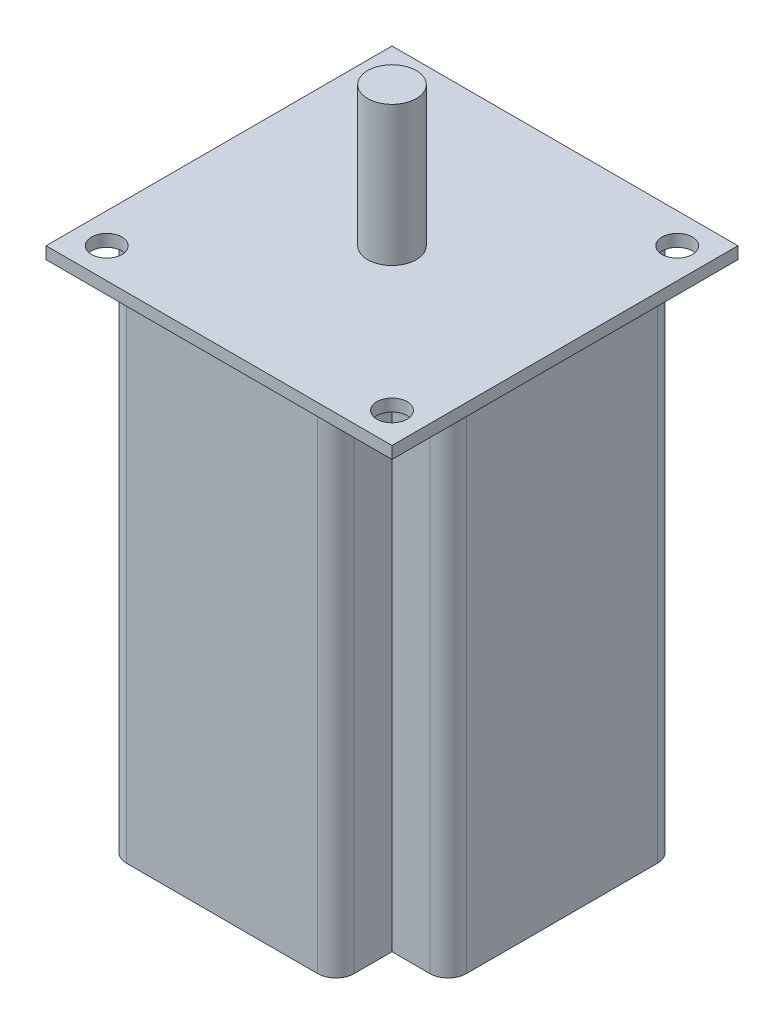
ISO-10303-21;
HEADER;
FILE_DESCRIPTION(('STEP AP214'),'2;1');
FILE_NAME('part.step','',(''),(''),'','','');
FILE_SCHEMA(('AUTOMOTIVE_DESIGN { 1 0 10303 214 1 1 1 1 }'));
ENDSEC;
DATA;
#1=APPLICATION_CONTEXT('core data for automotive mechanical design processes');
#2=APPLICATION_PROTOCOL_DEFINITION('international standard','automotive_design',2000,#1);
#3=PRODUCT_CONTEXT('',#1,'mechanical');
#4=PRODUCT('Part','Part','',(#3));
#5=PRODUCT_RELATED_PRODUCT_CATEGORY('part','',(#4));
#6=PRODUCT_DEFINITION_FORMATION('','',#4);
#7=PRODUCT_DEFINITION_CONTEXT('part definition',#1,'design');
#8=PRODUCT_DEFINITION('design','',#6,#7);
#9=PRODUCT_DEFINITION_SHAPE('','',#8);
#10=(LENGTH_UNIT() NAMED_UNIT(*) SI_UNIT(.MILLI.,.METRE.));
#11=(NAMED_UNIT(*) PLANE_ANGLE_UNIT() SI_UNIT($,.RADIAN.));
#12=(NAMED_UNIT(*) SI_UNIT($,.STERADIAN.) SOLID_ANGLE_UNIT());
#13=UNCERTAINTY_MEASURE_WITH_UNIT(LENGTH_MEASURE(1.E-05),#10,'distance_accuracy_value','');
#14=(GEOMETRIC_REPRESENTATION_CONTEXT(3) GLOBAL_UNCERTAINTY_ASSIGNED_CONTEXT((#13)) GLOBAL_UNIT_ASSIGNED_CONTEXT((#10,
#11,#12)) REPRESENTATION_CONTEXT('',''));
#15=CARTESIAN_POINT('',(0.,0.,0.));
#16=DIRECTION('',(0.,0.,1.));
#17=DIRECTION('',(1.,0.,0.));
#18=AXIS2_PLACEMENT_3D('',#15,#16,#17);
#19=CARTESIAN_POINT('',(-25.,82.,-15.75));
#20=DIRECTION('',(0.,-1.,0.));
#21=DIRECTION('',(0.,0.,-1.));
#22=AXIS2_PLACEMENT_3D('',#19,#20,#21);
#23=CYLINDRICAL_SURFACE('',#22,3.);
#24=DIRECTION('',(0.,-1.,0.));
#25=VECTOR('',#24,1.);
#26=CARTESIAN_POINT('',(-28.,82.,-15.75));
#27=LINE('',#26,#25);
#28=CARTESIAN_POINT('',(-28.,80.,-15.75));
#29=VERTEX_POINT('',#28);
#30=CARTESIAN_POINT('',(-28.,0.,-15.75));
#31=VERTEX_POINT('',#30);
#32=EDGE_CURVE('E49',#29,#31,#27,.T.);
#33=ORIENTED_EDGE('',*,*,#32,.F.);
#34=CARTESIAN_POINT('',(-25.,80.,-15.75));
#35=DIRECTION('',(0.,1.,0.));
#36=DIRECTION('',(0.,0.,1.));
#37=AXIS2_PLACEMENT_3D('',#34,#35,#36);
#38=CIRCLE('',#37,3.);
#39=CARTESIAN_POINT('',(-25.,80.,-18.75));
#40=VERTEX_POINT('',#39);
#41=EDGE_CURVE('E321',#29,#40,#38,.F.);
#42=ORIENTED_EDGE('',*,*,#41,.T.);
#43=DIRECTION('',(0.,-1.,0.));
#44=VECTOR('',#43,1.);
#45=CARTESIAN_POINT('',(-25.,82.,-18.75));
#46=LINE('',#45,#44);
#47=CARTESIAN_POINT('',(-25.,0.,-18.75));
#48=VERTEX_POINT('',#47);
#49=EDGE_CURVE('E63',#40,#48,#46,.T.);
#50=ORIENTED_EDGE('',*,*,#49,.T.);
#51=CARTESIAN_POINT('',(-25.,0.,-15.75));
#52=DIRECTION('',(0.,1.,0.));
#53=DIRECTION('',(0.,0.,1.));
#54=AXIS2_PLACEMENT_3D('',#51,#52,#53);
#55=CIRCLE('',#54,3.);
#56=EDGE_CURVE('E324',#31,#48,#55,.F.);
#57=ORIENTED_EDGE('',*,*,#56,.F.);
#58=EDGE_LOOP('',(#33,#42,#50,#57));
#59=FACE_BOUND('',#58,.T.);
#60=ADVANCED_FACE('F41',(#59),#23,.T.);
#61=CARTESIAN_POINT('',(-28.,82.,0.));
#62=DIRECTION('',(1.,0.,0.));
#63=DIRECTION('',(0.,0.,-1.));
#64=AXIS2_PLACEMENT_3D('',#61,#62,#63);
#65=PLANE('',#64);
#66=DIRECTION('',(0.,0.,1.));
#67=VECTOR('',#66,1.);
#68=CARTESIAN_POINT('',(-28.,80.,0.));
#69=LINE('',#68,#67);
#70=CARTESIAN_POINT('',(-28.,80.,15.75));
#71=VERTEX_POINT('',#70);
#72=EDGE_CURVE('E318',#29,#71,#69,.T.);
#73=ORIENTED_EDGE('',*,*,#72,.F.);
#74=ORIENTED_EDGE('',*,*,#32,.T.);
#75=DIRECTION('',(0.,0.,1.));
#76=VECTOR('',#75,1.);
#77=CARTESIAN_POINT('',(-28.,0.,0.));
#78=LINE('',#77,#76);
#79=CARTESIAN_POINT('',(-28.,0.,15.75));
#80=VERTEX_POINT('',#79);
#81=EDGE_CURVE('E327',#31,#80,#78,.T.);
#82=ORIENTED_EDGE('',*,*,#81,.T.);
#83=DIRECTION('',(0.,-1.,0.));
#84=VECTOR('',#83,1.);
#85=CARTESIAN_POINT('',(-28.,82.,15.75));
#86=LINE('',#85,#84);
#87=EDGE_CURVE('E456',#71,#80,#86,.T.);
#88=ORIENTED_EDGE('',*,*,#87,.F.);
#89=EDGE_LOOP('',(#73,#74,#82,#88));
#90=FACE_BOUND('',#89,.T.);
#91=ADVANCED_FACE('F463',(#90),#65,.F.);
#92=CARTESIAN_POINT('',(-25.,82.,15.75));
#93=DIRECTION('',(0.,-1.,0.));
#94=DIRECTION('',(0.,0.,-1.));
#95=AXIS2_PLACEMENT_3D('',#92,#93,#94);
#96=CYLINDRICAL_SURFACE('',#95,3.);
#97=CARTESIAN_POINT('',(-25.,80.,15.75));
#98=DIRECTION('',(0.,1.,0.));
#99=DIRECTION('',(0.,0.,1.));
#100=AXIS2_PLACEMENT_3D('',#97,#98,#99);
#101=CIRCLE('',#100,3.);
#102=CARTESIAN_POINT('',(-25.,80.,18.75));
#103=VERTEX_POINT('',#102);
#104=EDGE_CURVE('E315',#71,#103,#101,.T.);
#105=ORIENTED_EDGE('',*,*,#104,.F.);
#106=ORIENTED_EDGE('',*,*,#87,.T.);
#107=CARTESIAN_POINT('',(-25.,0.,15.75));
#108=DIRECTION('',(0.,1.,0.));
#109=DIRECTION('',(0.,0.,1.));
#110=AXIS2_PLACEMENT_3D('',#107,#108,#109);
#111=CIRCLE('',#110,3.);
#112=CARTESIAN_POINT('',(-25.,0.,18.75));
#113=VERTEX_POINT('',#112);
#114=EDGE_CURVE('E331',#80,#113,#111,.T.);
#115=ORIENTED_EDGE('',*,*,#114,.T.);
#116=DIRECTION('',(0.,-1.,0.));
#117=VECTOR('',#116,1.);
#118=CARTESIAN_POINT('',(-25.,82.,18.75));
#119=LINE('',#118,#117);
#120=EDGE_CURVE('E453',#103,#113,#119,.T.);
#121=ORIENTED_EDGE('',*,*,#120,.F.);
#122=EDGE_LOOP('',(#105,#106,#115,#121));
#123=FACE_BOUND('',#122,.T.);
#124=ADVANCED_FACE('F474',(#123),#96,.T.);
#125=CARTESIAN_POINT('',(0.,82.,18.75));
#126=DIRECTION('',(0.,0.,-1.));
#127=DIRECTION('',(-1.,0.,0.));
#128=AXIS2_PLACEMENT_3D('',#125,#126,#127);
#129=PLANE('',#128);
#130=DIRECTION('',(1.,0.,0.));
#131=VECTOR('',#130,1.);
#132=CARTESIAN_POINT('',(0.,80.,18.75));
#133=LINE('',#132,#131);
#134=CARTESIAN_POINT('',(-18.75,80.,18.75));
#135=VERTEX_POINT('',#134);
#136=EDGE_CURVE('E312',#103,#135,#133,.T.);
#137=ORIENTED_EDGE('',*,*,#136,.F.);
#138=ORIENTED_EDGE('',*,*,#120,.T.);
#139=DIRECTION('',(1.,0.,0.));
#140=VECTOR('',#139,1.);
#141=CARTESIAN_POINT('',(0.,0.,18.75));
#142=LINE('',#141,#140);
#143=CARTESIAN_POINT('',(-18.75,0.,18.75));
#144=VERTEX_POINT('',#143);
#145=EDGE_CURVE('E335',#113,#144,#142,.T.);
#146=ORIENTED_EDGE('',*,*,#145,.T.);
#147=DIRECTION('',(0.,-1.,0.));
#148=VECTOR('',#147,1.);
#149=CARTESIAN_POINT('',(-18.75,82.,18.75));
#150=LINE('',#149,#148);
#151=EDGE_CURVE('E450',#135,#144,#150,.T.);
#152=ORIENTED_EDGE('',*,*,#151,.F.);
#153=EDGE_LOOP('',(#137,#138,#146,#152));
#154=FACE_BOUND('',#153,.T.);
#155=ADVANCED_FACE('F478',(#154),#129,.F.);
#156=CARTESIAN_POINT('',(-18.75,82.,0.));
#157=DIRECTION('',(1.,0.,0.));
#158=DIRECTION('',(0.,0.,-1.));
#159=AXIS2_PLACEMENT_3D('',#156,#157,#158);
#160=PLANE('',#159);
#161=DIRECTION('',(0.,0.,1.));
#162=VECTOR('',#161,1.);
#163=CARTESIAN_POINT('',(-18.75,80.,0.));
#164=LINE('',#163,#162);
#165=CARTESIAN_POINT('',(-18.75,80.,25.));
#166=VERTEX_POINT('',#165);
#167=EDGE_CURVE('E309',#135,#166,#164,.T.);
#168=ORIENTED_EDGE('',*,*,#167,.F.);
#169=ORIENTED_EDGE('',*,*,#151,.T.);
#170=DIRECTION('',(0.,0.,1.));
#171=VECTOR('',#170,1.);
#172=CARTESIAN_POINT('',(-18.75,0.,0.));
#173=LINE('',#172,#171);
#174=CARTESIAN_POINT('',(-18.75,0.,25.));
#175=VERTEX_POINT('',#174);
#176=EDGE_CURVE('E339',#144,#175,#173,.T.);
#177=ORIENTED_EDGE('',*,*,#176,.T.);
#178=DIRECTION('',(0.,-1.,0.));
#179=VECTOR('',#178,1.);
#180=CARTESIAN_POINT('',(-18.75,82.,25.));
#181=LINE('',#180,#179);
#182=EDGE_CURVE('E447',#166,#175,#181,.T.);
#183=ORIENTED_EDGE('',*,*,#182,.F.);
#184=EDGE_LOOP('',(#168,#169,#177,#183));
#185=FACE_BOUND('',#184,.T.);
#186=ADVANCED_FACE('F484',(#185),#160,.F.);
#187=CARTESIAN_POINT('',(-15.75,82.,25.));
#188=DIRECTION('',(0.,-1.,0.));
#189=DIRECTION('',(0.,0.,-1.));
#190=AXIS2_PLACEMENT_3D('',#187,#188,#189);
#191=CYLINDRICAL_SURFACE('',#190,3.);
#192=DIRECTION('',(0.,-1.,0.));
#193=VECTOR('',#192,1.);
#194=CARTESIAN_POINT('',(-15.75,82.,28.));
#195=LINE('',#194,#193);
#196=CARTESIAN_POINT('',(-15.75,80.,28.));
#197=VERTEX_POINT('',#196);
#198=CARTESIAN_POINT('',(-15.75,0.,28.));
#199=VERTEX_POINT('',#198);
#200=EDGE_CURVE('E444',#197,#199,#195,.T.);
#201=ORIENTED_EDGE('',*,*,#200,.F.);
#202=CARTESIAN_POINT('',(-15.75,80.,25.));
#203=DIRECTION('',(0.,1.,0.));
#204=DIRECTION('',(0.,0.,1.));
#205=AXIS2_PLACEMENT_3D('',#202,#203,#204);
#206=CIRCLE('',#205,3.);
#207=EDGE_CURVE('E305',#197,#166,#206,.F.);
#208=ORIENTED_EDGE('',*,*,#207,.T.);
#209=ORIENTED_EDGE('',*,*,#182,.T.);
#210=CARTESIAN_POINT('',(-15.75,0.,25.));
#211=DIRECTION('',(0.,1.,0.));
#212=DIRECTION('',(0.,0.,1.));
#213=AXIS2_PLACEMENT_3D('',#210,#211,#212);
#214=CIRCLE('',#213,3.);
#215=EDGE_CURVE('E343',#199,#175,#214,.F.);
#216=ORIENTED_EDGE('',*,*,#215,.F.);
#217=EDGE_LOOP('',(#201,#208,#209,#216));
#218=FACE_BOUND('',#217,.T.);
#219=ADVANCED_FACE('F488',(#218),#191,.T.);
#220=CARTESIAN_POINT('',(0.,82.,28.));
#221=DIRECTION('',(0.,0.,-1.));
#222=DIRECTION('',(-1.,0.,0.));
#223=AXIS2_PLACEMENT_3D('',#220,#221,#222);
#224=PLANE('',#223);
#225=DIRECTION('',(1.,0.,0.));
#226=VECTOR('',#225,1.);
#227=CARTESIAN_POINT('',(0.,80.,28.));
#228=LINE('',#227,#226);
#229=CARTESIAN_POINT('',(15.75,80.,28.));
#230=VERTEX_POINT('',#229);
#231=EDGE_CURVE('E302',#197,#230,#228,.T.);
#232=ORIENTED_EDGE('',*,*,#231,.F.);
#233=ORIENTED_EDGE('',*,*,#200,.T.);
#234=DIRECTION('',(1.,0.,0.));
#235=VECTOR('',#234,1.);
#236=CARTESIAN_POINT('',(0.,0.,28.));
#237=LINE('',#236,#235);
#238=CARTESIAN_POINT('',(15.75,0.,28.));
#239=VERTEX_POINT('',#238);
#240=EDGE_CURVE('E347',#199,#239,#237,.T.);
#241=ORIENTED_EDGE('',*,*,#240,.T.);
#242=DIRECTION('',(0.,-1.,0.));
#243=VECTOR('',#242,1.);
#244=CARTESIAN_POINT('',(15.75,82.,28.));
#245=LINE('',#244,#243);
#246=EDGE_CURVE('E441',#230,#239,#245,.T.);
#247=ORIENTED_EDGE('',*,*,#246,.F.);
#248=EDGE_LOOP('',(#232,#233,#241,#247));
#249=FACE_BOUND('',#248,.T.);
#250=ADVANCED_FACE('F492',(#249),#224,.F.);
#251=CARTESIAN_POINT('',(15.75,82.,25.));
#252=DIRECTION('',(0.,-1.,0.));
#253=DIRECTION('',(0.,0.,-1.));
#254=AXIS2_PLACEMENT_3D('',#251,#252,#253);
#255=CYLINDRICAL_SURFACE('',#254,3.);
#256=CARTESIAN_POINT('',(15.75,80.,25.));
#257=DIRECTION('',(0.,1.,0.));
#258=DIRECTION('',(0.,0.,1.));
#259=AXIS2_PLACEMENT_3D('',#256,#257,#258);
#260=CIRCLE('',#259,3.);
#261=CARTESIAN_POINT('',(18.75,80.,25.));
#262=VERTEX_POINT('',#261);
#263=EDGE_CURVE('E299',#230,#262,#260,.T.);
#264=ORIENTED_EDGE('',*,*,#263,.F.);
#265=ORIENTED_EDGE('',*,*,#246,.T.);
#266=CARTESIAN_POINT('',(15.75,0.,25.));
#267=DIRECTION('',(0.,1.,0.));
#268=DIRECTION('',(0.,0.,1.));
#269=AXIS2_PLACEMENT_3D('',#266,#267,#268);
#270=CIRCLE('',#269,3.);
#271=CARTESIAN_POINT('',(18.75,0.,25.));
#272=VERTEX_POINT('',#271);
#273=EDGE_CURVE('E351',#239,#272,#270,.T.);
#274=ORIENTED_EDGE('',*,*,#273,.T.);
#275=DIRECTION('',(0.,-1.,0.));
#276=VECTOR('',#275,1.);
#277=CARTESIAN_POINT('',(18.75,82.,25.));
#278=LINE('',#277,#276);
#279=EDGE_CURVE('E438',#262,#272,#278,.T.);
#280=ORIENTED_EDGE('',*,*,#279,.F.);
#281=EDGE_LOOP('',(#264,#265,#274,#280));
#282=FACE_BOUND('',#281,.T.);
#283=ADVANCED_FACE('F496',(#282),#255,.T.);
#284=CARTESIAN_POINT('',(18.75,82.,0.));
#285=DIRECTION('',(1.,0.,0.));
#286=DIRECTION('',(0.,0.,-1.));
#287=AXIS2_PLACEMENT_3D('',#284,#285,#286);
#288=PLANE('',#287);
#289=DIRECTION('',(0.,-1.,0.));
#290=VECTOR('',#289,1.);
#291=CARTESIAN_POINT('',(18.75,82.,18.75));
#292=LINE('',#291,#290);
#293=CARTESIAN_POINT('',(18.75,80.,18.75));
#294=VERTEX_POINT('',#293);
#295=CARTESIAN_POINT('',(18.75,0.,18.75));
#296=VERTEX_POINT('',#295);
#297=EDGE_CURVE('E435',#294,#296,#292,.T.);
#298=ORIENTED_EDGE('',*,*,#297,.F.);
#299=DIRECTION('',(0.,0.,1.));
#300=VECTOR('',#299,1.);
#301=CARTESIAN_POINT('',(18.75,80.,0.));
#302=LINE('',#301,#300);
#303=EDGE_CURVE('E295',#294,#262,#302,.T.);
#304=ORIENTED_EDGE('',*,*,#303,.T.);
#305=ORIENTED_EDGE('',*,*,#279,.T.);
#306=DIRECTION('',(0.,0.,1.));
#307=VECTOR('',#306,1.);
#308=CARTESIAN_POINT('',(18.75,0.,0.));
#309=LINE('',#308,#307);
#310=EDGE_CURVE('E355',#296,#272,#309,.T.);
#311=ORIENTED_EDGE('',*,*,#310,.F.);
#312=EDGE_LOOP('',(#298,#304,#305,#311));
#313=FACE_BOUND('',#312,.T.);
#314=ADVANCED_FACE('F500',(#313),#288,.T.);
#315=CARTESIAN_POINT('',(0.,82.,18.75));
#316=DIRECTION('',(0.,0.,-1.));
#317=DIRECTION('',(-1.,0.,0.));
#318=AXIS2_PLACEMENT_3D('',#315,#316,#317);
#319=PLANE('',#318);
#320=DIRECTION('',(1.,0.,0.));
#321=VECTOR('',#320,1.);
#322=CARTESIAN_POINT('',(0.,80.,18.75));
#323=LINE('',#322,#321);
#324=CARTESIAN_POINT('',(25.,80.,18.75));
#325=VERTEX_POINT('',#324);
#326=EDGE_CURVE('E292',#294,#325,#323,.T.);
#327=ORIENTED_EDGE('',*,*,#326,.F.);
#328=ORIENTED_EDGE('',*,*,#297,.T.);
#329=DIRECTION('',(1.,0.,0.));
#330=VECTOR('',#329,1.);
#331=CARTESIAN_POINT('',(0.,0.,18.75));
#332=LINE('',#331,#330);
#333=CARTESIAN_POINT('',(25.,0.,18.75));
#334=VERTEX_POINT('',#333);
#335=EDGE_CURVE('E359',#296,#334,#332,.T.);
#336=ORIENTED_EDGE('',*,*,#335,.T.);
#337=DIRECTION('',(0.,-1.,0.));
#338=VECTOR('',#337,1.);
#339=CARTESIAN_POINT('',(25.,82.,18.75));
#340=LINE('',#339,#338);
#341=EDGE_CURVE('E432',#325,#334,#340,.T.);
#342=ORIENTED_EDGE('',*,*,#341,.F.);
#343=EDGE_LOOP('',(#327,#328,#336,#342));
#344=FACE_BOUND('',#343,.T.);
#345=ADVANCED_FACE('F504',(#344),#319,.F.);
#346=CARTESIAN_POINT('',(25.,82.,15.75));
#347=DIRECTION('',(0.,-1.,0.));
#348=DIRECTION('',(0.,0.,-1.));
#349=AXIS2_PLACEMENT_3D('',#346,#347,#348);
#350=CYLINDRICAL_SURFACE('',#349,3.);
#351=DIRECTION('',(0.,-1.,0.));
#352=VECTOR('',#351,1.);
#353=CARTESIAN_POINT('',(28.,82.,15.75));
#354=LINE('',#353,#352);
#355=CARTESIAN_POINT('',(28.,80.,15.75));
#356=VERTEX_POINT('',#355);
#357=CARTESIAN_POINT('',(28.,0.,15.75));
#358=VERTEX_POINT('',#357);
#359=EDGE_CURVE('E429',#356,#358,#354,.T.);
#360=ORIENTED_EDGE('',*,*,#359,.F.);
#361=CARTESIAN_POINT('',(25.,80.,15.75));
#362=DIRECTION('',(0.,1.,0.));
#363=DIRECTION('',(0.,0.,1.));
#364=AXIS2_PLACEMENT_3D('',#361,#362,#363);
#365=CIRCLE('',#364,3.);
#366=EDGE_CURVE('E288',#356,#325,#365,.F.);
#367=ORIENTED_EDGE('',*,*,#366,.T.);
#368=ORIENTED_EDGE('',*,*,#341,.T.);
#369=CARTESIAN_POINT('',(25.,0.,15.75));
#370=DIRECTION('',(0.,1.,0.));
#371=DIRECTION('',(0.,0.,1.));
#372=AXIS2_PLACEMENT_3D('',#369,#370,#371);
#373=CIRCLE('',#372,3.);
#374=EDGE_CURVE('E363',#358,#334,#373,.F.);
#375=ORIENTED_EDGE('',*,*,#374,.F.);
#376=EDGE_LOOP('',(#360,#367,#368,#375));
#377=FACE_BOUND('',#376,.T.);
#378=ADVANCED_FACE('F508',(#377),#350,.T.);
#379=CARTESIAN_POINT('',(28.,82.,0.));
#380=DIRECTION('',(1.,0.,0.));
#381=DIRECTION('',(0.,0.,-1.));
#382=AXIS2_PLACEMENT_3D('',#379,#380,#381);
#383=PLANE('',#382);
#384=DIRECTION('',(0.,-1.,0.));
#385=VECTOR('',#384,1.);
#386=CARTESIAN_POINT('',(28.,82.,-15.75));
#387=LINE('',#386,#385);
#388=CARTESIAN_POINT('',(28.,80.,-15.75));
#389=VERTEX_POINT('',#388);
#390=CARTESIAN_POINT('',(28.,0.,-15.75));
#391=VERTEX_POINT('',#390);
#392=EDGE_CURVE('E426',#389,#391,#387,.T.);
#393=ORIENTED_EDGE('',*,*,#392,.F.);
#394=DIRECTION('',(0.,0.,1.));
#395=VECTOR('',#394,1.);
#396=CARTESIAN_POINT('',(28.,80.,0.));
#397=LINE('',#396,#395);
#398=EDGE_CURVE('E284',#389,#356,#397,.T.);
#399=ORIENTED_EDGE('',*,*,#398,.T.);
#400=ORIENTED_EDGE('',*,*,#359,.T.);
#401=DIRECTION('',(0.,0.,1.));
#402=VECTOR('',#401,1.);
#403=CARTESIAN_POINT('',(28.,0.,0.));
#404=LINE('',#403,#402);
#405=EDGE_CURVE('E367',#391,#358,#404,.T.);
#406=ORIENTED_EDGE('',*,*,#405,.F.);
#407=EDGE_LOOP('',(#393,#399,#400,#406));
#408=FACE_BOUND('',#407,.T.);
#409=ADVANCED_FACE('F512',(#408),#383,.T.);
#410=CARTESIAN_POINT('',(25.,82.,-15.75));
#411=DIRECTION('',(0.,-1.,0.));
#412=DIRECTION('',(0.,0.,-1.));
#413=AXIS2_PLACEMENT_3D('',#410,#411,#412);
#414=CYLINDRICAL_SURFACE('',#413,3.);
#415=CARTESIAN_POINT('',(25.,80.,-15.75));
#416=DIRECTION('',(0.,1.,0.));
#417=DIRECTION('',(0.,0.,1.));
#418=AXIS2_PLACEMENT_3D('',#415,#416,#417);
#419=CIRCLE('',#418,3.);
#420=CARTESIAN_POINT('',(25.,80.,-18.75));
#421=VERTEX_POINT('',#420);
#422=EDGE_CURVE('E281',#389,#421,#419,.T.);
#423=ORIENTED_EDGE('',*,*,#422,.F.);
#424=ORIENTED_EDGE('',*,*,#392,.T.);
#425=CARTESIAN_POINT('',(25.,0.,-15.75));
#426=DIRECTION('',(0.,1.,0.));
#427=DIRECTION('',(0.,0.,1.));
#428=AXIS2_PLACEMENT_3D('',#425,#426,#427);
#429=CIRCLE('',#428,3.);
#430=CARTESIAN_POINT('',(25.,0.,-18.75));
#431=VERTEX_POINT('',#430);
#432=EDGE_CURVE('E371',#391,#431,#429,.T.);
#433=ORIENTED_EDGE('',*,*,#432,.T.);
#434=DIRECTION('',(0.,-1.,0.));
#435=VECTOR('',#434,1.);
#436=CARTESIAN_POINT('',(25.,82.,-18.75));
#437=LINE('',#436,#435);
#438=EDGE_CURVE('E423',#421,#431,#437,.T.);
#439=ORIENTED_EDGE('',*,*,#438,.F.);
#440=EDGE_LOOP('',(#423,#424,#433,#439));
#441=FACE_BOUND('',#440,.T.);
#442=ADVANCED_FACE('F516',(#441),#414,.T.);
#443=CARTESIAN_POINT('',(0.,82.,-18.75));
#444=DIRECTION('',(0.,0.,-1.));
#445=DIRECTION('',(-1.,0.,0.));
#446=AXIS2_PLACEMENT_3D('',#443,#444,#445);
#447=PLANE('',#446);
#448=DIRECTION('',(0.,-1.,0.));
#449=VECTOR('',#448,1.);
#450=CARTESIAN_POINT('',(18.75,82.,-18.75));
#451=LINE('',#450,#449);
#452=CARTESIAN_POINT('',(18.75,80.,-18.75));
#453=VERTEX_POINT('',#452);
#454=CARTESIAN_POINT('',(18.75,0.,-18.75));
#455=VERTEX_POINT('',#454);
#456=EDGE_CURVE('E420',#453,#455,#451,.T.);
#457=ORIENTED_EDGE('',*,*,#456,.F.);
#458=DIRECTION('',(1.,0.,0.));
#459=VECTOR('',#458,1.);
#460=CARTESIAN_POINT('',(0.,80.,-18.75));
#461=LINE('',#460,#459);
#462=EDGE_CURVE('E277',#453,#421,#461,.T.);
#463=ORIENTED_EDGE('',*,*,#462,.T.);
#464=ORIENTED_EDGE('',*,*,#438,.T.);
#465=DIRECTION('',(1.,0.,0.));
#466=VECTOR('',#465,1.);
#467=CARTESIAN_POINT('',(0.,0.,-18.75));
#468=LINE('',#467,#466);
#469=EDGE_CURVE('E375',#455,#431,#468,.T.);
#470=ORIENTED_EDGE('',*,*,#469,.F.);
#471=EDGE_LOOP('',(#457,#463,#464,#470));
#472=FACE_BOUND('',#471,.T.);
#473=ADVANCED_FACE('F520',(#472),#447,.T.);
#474=CARTESIAN_POINT('',(18.75,82.,0.));
#475=DIRECTION('',(1.,0.,0.));
#476=DIRECTION('',(0.,0.,-1.));
#477=AXIS2_PLACEMENT_3D('',#474,#475,#476);
#478=PLANE('',#477);
#479=DIRECTION('',(0.,-1.,0.));
#480=VECTOR('',#479,1.);
#481=CARTESIAN_POINT('',(18.75,82.,-25.));
#482=LINE('',#481,#480);
#483=CARTESIAN_POINT('',(18.75,80.,-25.));
#484=VERTEX_POINT('',#483);
#485=CARTESIAN_POINT('',(18.75,0.,-25.));
#486=VERTEX_POINT('',#485);
#487=EDGE_CURVE('E417',#484,#486,#482,.T.);
#488=ORIENTED_EDGE('',*,*,#487,.F.);
#489=DIRECTION('',(0.,0.,1.));
#490=VECTOR('',#489,1.);
#491=CARTESIAN_POINT('',(18.75,80.,0.));
#492=LINE('',#491,#490);
#493=EDGE_CURVE('E273',#484,#453,#492,.T.);
#494=ORIENTED_EDGE('',*,*,#493,.T.);
#495=ORIENTED_EDGE('',*,*,#456,.T.);
#496=DIRECTION('',(0.,0.,1.));
#497=VECTOR('',#496,1.);
#498=CARTESIAN_POINT('',(18.75,0.,0.));
#499=LINE('',#498,#497);
#500=EDGE_CURVE('E379',#486,#455,#499,.T.);
#501=ORIENTED_EDGE('',*,*,#500,.F.);
#502=EDGE_LOOP('',(#488,#494,#495,#501));
#503=FACE_BOUND('',#502,.T.);
#504=ADVANCED_FACE('F524',(#503),#478,.T.);
#505=CARTESIAN_POINT('',(15.75,82.,-25.));
#506=DIRECTION('',(0.,-1.,0.));
#507=DIRECTION('',(0.,0.,-1.));
#508=AXIS2_PLACEMENT_3D('',#505,#506,#507);
#509=CYLINDRICAL_SURFACE('',#508,3.);
#510=CARTESIAN_POINT('',(15.75,80.,-25.));
#511=DIRECTION('',(0.,1.,0.));
#512=DIRECTION('',(0.,0.,1.));
#513=AXIS2_PLACEMENT_3D('',#510,#511,#512);
#514=CIRCLE('',#513,3.);
#515=CARTESIAN_POINT('',(15.75,80.,-28.));
#516=VERTEX_POINT('',#515);
#517=EDGE_CURVE('E270',#484,#516,#514,.T.);
#518=ORIENTED_EDGE('',*,*,#517,.F.);
#519=ORIENTED_EDGE('',*,*,#487,.T.);
#520=CARTESIAN_POINT('',(15.75,0.,-25.));
#521=DIRECTION('',(0.,1.,0.));
#522=DIRECTION('',(0.,0.,1.));
#523=AXIS2_PLACEMENT_3D('',#520,#521,#522);
#524=CIRCLE('',#523,3.);
#525=CARTESIAN_POINT('',(15.75,0.,-28.));
#526=VERTEX_POINT('',#525);
#527=EDGE_CURVE('E383',#486,#526,#524,.T.);
#528=ORIENTED_EDGE('',*,*,#527,.T.);
#529=DIRECTION('',(0.,-1.,0.));
#530=VECTOR('',#529,1.);
#531=CARTESIAN_POINT('',(15.75,82.,-28.));
#532=LINE('',#531,#530);
#533=EDGE_CURVE('E414',#516,#526,#532,.T.);
#534=ORIENTED_EDGE('',*,*,#533,.F.);
#535=EDGE_LOOP('',(#518,#519,#528,#534));
#536=FACE_BOUND('',#535,.T.);
#537=ADVANCED_FACE('F528',(#536),#509,.T.);
#538=CARTESIAN_POINT('',(0.,82.,-28.));
#539=DIRECTION('',(0.,0.,-1.));
#540=DIRECTION('',(-1.,0.,0.));
#541=AXIS2_PLACEMENT_3D('',#538,#539,#540);
#542=PLANE('',#541);
#543=DIRECTION('',(0.,-1.,0.));
#544=VECTOR('',#543,1.);
#545=CARTESIAN_POINT('',(-15.75,82.,-28.));
#546=LINE('',#545,#544);
#547=CARTESIAN_POINT('',(-15.75,80.,-28.));
#548=VERTEX_POINT('',#547);
#549=CARTESIAN_POINT('',(-15.75,0.,-28.));
#550=VERTEX_POINT('',#549);
#551=EDGE_CURVE('E411',#548,#550,#546,.T.);
#552=ORIENTED_EDGE('',*,*,#551,.F.);
#553=DIRECTION('',(1.,0.,0.));
#554=VECTOR('',#553,1.);
#555=CARTESIAN_POINT('',(0.,80.,-28.));
#556=LINE('',#555,#554);
#557=EDGE_CURVE('E266',#548,#516,#556,.T.);
#558=ORIENTED_EDGE('',*,*,#557,.T.);
#559=ORIENTED_EDGE('',*,*,#533,.T.);
#560=DIRECTION('',(1.,0.,0.));
#561=VECTOR('',#560,1.);
#562=CARTESIAN_POINT('',(0.,0.,-28.));
#563=LINE('',#562,#561);
#564=EDGE_CURVE('E387',#550,#526,#563,.T.);
#565=ORIENTED_EDGE('',*,*,#564,.F.);
#566=EDGE_LOOP('',(#552,#558,#559,#565));
#567=FACE_BOUND('',#566,.T.);
#568=ADVANCED_FACE('F532',(#567),#542,.T.);
#569=CARTESIAN_POINT('',(-15.75,82.,-25.));
#570=DIRECTION('',(0.,-1.,0.));
#571=DIRECTION('',(0.,0.,-1.));
#572=AXIS2_PLACEMENT_3D('',#569,#570,#571);
#573=CYLINDRICAL_SURFACE('',#572,3.);
#574=CARTESIAN_POINT('',(-15.75,80.,-25.));
#575=DIRECTION('',(0.,1.,0.));
#576=DIRECTION('',(0.,0.,1.));
#577=AXIS2_PLACEMENT_3D('',#574,#575,#576);
#578=CIRCLE('',#577,3.);
#579=CARTESIAN_POINT('',(-18.75,80.,-25.));
#580=VERTEX_POINT('',#579);
#581=EDGE_CURVE('E263',#548,#580,#578,.T.);
#582=ORIENTED_EDGE('',*,*,#581,.F.);
#583=ORIENTED_EDGE('',*,*,#551,.T.);
#584=CARTESIAN_POINT('',(-15.75,0.,-25.));
#585=DIRECTION('',(0.,1.,0.));
#586=DIRECTION('',(0.,0.,1.));
#587=AXIS2_PLACEMENT_3D('',#584,#585,#586);
#588=CIRCLE('',#587,3.);
#589=CARTESIAN_POINT('',(-18.75,0.,-25.));
#590=VERTEX_POINT('',#589);
#591=EDGE_CURVE('E391',#550,#590,#588,.T.);
#592=ORIENTED_EDGE('',*,*,#591,.T.);
#593=DIRECTION('',(0.,-1.,0.));
#594=VECTOR('',#593,1.);
#595=CARTESIAN_POINT('',(-18.75,82.,-25.));
#596=LINE('',#595,#594);
#597=EDGE_CURVE('E408',#580,#590,#596,.T.);
#598=ORIENTED_EDGE('',*,*,#597,.F.);
#599=EDGE_LOOP('',(#582,#583,#592,#598));
#600=FACE_BOUND('',#599,.T.);
#601=ADVANCED_FACE('F536',(#600),#573,.T.);
#602=CARTESIAN_POINT('',(-18.75,82.,0.));
#603=DIRECTION('',(1.,0.,0.));
#604=DIRECTION('',(0.,0.,-1.));
#605=AXIS2_PLACEMENT_3D('',#602,#603,#604);
#606=PLANE('',#605);
#607=DIRECTION('',(0.,0.,1.));
#608=VECTOR('',#607,1.);
#609=CARTESIAN_POINT('',(-18.75,80.,0.));
#610=LINE('',#609,#608);
#611=CARTESIAN_POINT('',(-18.75,80.,-18.75));
#612=VERTEX_POINT('',#611);
#613=EDGE_CURVE('E56',#580,#612,#610,.T.);
#614=ORIENTED_EDGE('',*,*,#613,.F.);
#615=ORIENTED_EDGE('',*,*,#597,.T.);
#616=DIRECTION('',(0.,0.,1.));
#617=VECTOR('',#616,1.);
#618=CARTESIAN_POINT('',(-18.75,0.,0.));
#619=LINE('',#618,#617);
#620=CARTESIAN_POINT('',(-18.75,0.,-18.75));
#621=VERTEX_POINT('',#620);
#622=EDGE_CURVE('E395',#590,#621,#619,.T.);
#623=ORIENTED_EDGE('',*,*,#622,.T.);
#624=DIRECTION('',(0.,-1.,0.));
#625=VECTOR('',#624,1.);
#626=CARTESIAN_POINT('',(-18.75,82.,-18.75));
#627=LINE('',#626,#625);
#628=EDGE_CURVE('E405',#612,#621,#627,.T.);
#629=ORIENTED_EDGE('',*,*,#628,.F.);
#630=EDGE_LOOP('',(#614,#615,#623,#629));
#631=FACE_BOUND('',#630,.T.);
#632=ADVANCED_FACE('F540',(#631),#606,.F.);
#633=CARTESIAN_POINT('',(0.,82.,-18.75));
#634=DIRECTION('',(0.,0.,-1.));
#635=DIRECTION('',(-1.,0.,0.));
#636=AXIS2_PLACEMENT_3D('',#633,#634,#635);
#637=PLANE('',#636);
#638=ORIENTED_EDGE('',*,*,#49,.F.);
#639=DIRECTION('',(1.,0.,0.));
#640=VECTOR('',#639,1.);
#641=CARTESIAN_POINT('',(0.,80.,-18.75));
#642=LINE('',#641,#640);
#643=EDGE_CURVE('E11',#40,#612,#642,.T.);
#644=ORIENTED_EDGE('',*,*,#643,.T.);
#645=ORIENTED_EDGE('',*,*,#628,.T.);
#646=DIRECTION('',(1.,0.,0.));
#647=VECTOR('',#646,1.);
#648=CARTESIAN_POINT('',(0.,0.,-18.75));
#649=LINE('',#648,#647);
#650=EDGE_CURVE('E399',#48,#621,#649,.T.);
#651=ORIENTED_EDGE('',*,*,#650,.F.);
#652=EDGE_LOOP('',(#638,#644,#645,#651));
#653=FACE_BOUND('',#652,.T.);
#654=ADVANCED_FACE('F544',(#653),#637,.T.);
#655=CARTESIAN_POINT('',(0.,0.,0.));
#656=DIRECTION('',(0.,1.,0.));
#657=DIRECTION('',(0.,0.,1.));
#658=AXIS2_PLACEMENT_3D('',#655,#656,#657);
#659=PLANE('',#658);
#660=ORIENTED_EDGE('',*,*,#56,.T.);
#661=ORIENTED_EDGE('',*,*,#650,.T.);
#662=ORIENTED_EDGE('',*,*,#622,.F.);
#663=ORIENTED_EDGE('',*,*,#591,.F.);
#664=ORIENTED_EDGE('',*,*,#564,.T.);
#665=ORIENTED_EDGE('',*,*,#527,.F.);
#666=ORIENTED_EDGE('',*,*,#500,.T.);
#667=ORIENTED_EDGE('',*,*,#469,.T.);
#668=ORIENTED_EDGE('',*,*,#432,.F.);
#669=ORIENTED_EDGE('',*,*,#405,.T.);
#670=ORIENTED_EDGE('',*,*,#374,.T.);
#671=ORIENTED_EDGE('',*,*,#335,.F.);
#672=ORIENTED_EDGE('',*,*,#310,.T.);
#673=ORIENTED_EDGE('',*,*,#273,.F.);
#674=ORIENTED_EDGE('',*,*,#240,.F.);
#675=ORIENTED_EDGE('',*,*,#215,.T.);
#676=ORIENTED_EDGE('',*,*,#176,.F.);
#677=ORIENTED_EDGE('',*,*,#145,.F.);
#678=ORIENTED_EDGE('',*,*,#114,.F.);
#679=ORIENTED_EDGE('',*,*,#81,.F.);
#680=EDGE_LOOP('',(#660,#661,#662,#663,#664,#665,#666,#667,#668,#669,#670,#671,#672,#673,#674,
#675,#676,#677,#678,#679));
#681=FACE_BOUND('',#680,.T.);
#682=ADVANCED_FACE('F467',(#681),#659,.F.);
#683=CARTESIAN_POINT('',(28.5,80.,-28.5));
#684=DIRECTION('',(1.,0.,0.));
#685=DIRECTION('',(0.,0.,-1.));
#686=AXIS2_PLACEMENT_3D('',#683,#684,#685);
#687=PLANE('',#686);
#688=DIRECTION('',(0.,0.,-1.));
#689=VECTOR('',#688,1.);
#690=CARTESIAN_POINT('',(28.5,82.,-28.5));
#691=LINE('',#690,#689);
#692=CARTESIAN_POINT('',(28.5,82.,28.5));
#693=VERTEX_POINT('',#692);
#694=CARTESIAN_POINT('',(28.5,82.,-28.5));
#695=VERTEX_POINT('',#694);
#696=EDGE_CURVE('E245',#693,#695,#691,.T.);
#697=ORIENTED_EDGE('',*,*,#696,.F.);
#698=DIRECTION('',(0.,1.,0.));
#699=VECTOR('',#698,1.);
#700=CARTESIAN_POINT('',(28.5,80.,28.5));
#701=LINE('',#700,#699);
#702=CARTESIAN_POINT('',(28.5,80.,28.5));
#703=VERTEX_POINT('',#702);
#704=EDGE_CURVE('E229',#703,#693,#701,.T.);
#705=ORIENTED_EDGE('',*,*,#704,.F.);
#706=DIRECTION('',(0.,0.,-1.));
#707=VECTOR('',#706,1.);
#708=CARTESIAN_POINT('',(28.5,80.,-28.5));
#709=LINE('',#708,#707);
#710=CARTESIAN_POINT('',(28.5,80.,-28.5));
#711=VERTEX_POINT('',#710);
#712=EDGE_CURVE('E222',#703,#711,#709,.T.);
#713=ORIENTED_EDGE('',*,*,#712,.T.);
#714=DIRECTION('',(0.,1.,0.));
#715=VECTOR('',#714,1.);
#716=CARTESIAN_POINT('',(28.5,80.,-28.5));
#717=LINE('',#716,#715);
#718=EDGE_CURVE('E203',#711,#695,#717,.T.);
#719=ORIENTED_EDGE('',*,*,#718,.T.);
#720=EDGE_LOOP('',(#697,#705,#713,#719));
#721=FACE_BOUND('',#720,.T.);
#722=ADVANCED_FACE('F228',(#721),#687,.T.);
#723=CARTESIAN_POINT('',(-28.5,80.,28.5));
#724=DIRECTION('',(0.,0.,1.));
#725=DIRECTION('',(1.,0.,0.));
#726=AXIS2_PLACEMENT_3D('',#723,#724,#725);
#727=PLANE('',#726);
#728=DIRECTION('',(1.,0.,0.));
#729=VECTOR('',#728,1.);
#730=CARTESIAN_POINT('',(-28.5,82.,28.5));
#731=LINE('',#730,#729);
#732=CARTESIAN_POINT('',(-28.5,82.,28.5));
#733=VERTEX_POINT('',#732);
#734=EDGE_CURVE('E231',#733,#693,#731,.T.);
#735=ORIENTED_EDGE('',*,*,#734,.F.);
#736=DIRECTION('',(0.,1.,0.));
#737=VECTOR('',#736,1.);
#738=CARTESIAN_POINT('',(-28.5,80.,28.5));
#739=LINE('',#738,#737);
#740=CARTESIAN_POINT('',(-28.5,80.,28.5));
#741=VERTEX_POINT('',#740);
#742=EDGE_CURVE('E256',#741,#733,#739,.T.);
#743=ORIENTED_EDGE('',*,*,#742,.F.);
#744=DIRECTION('',(1.,0.,0.));
#745=VECTOR('',#744,1.);
#746=CARTESIAN_POINT('',(-28.5,80.,28.5));
#747=LINE('',#746,#745);
#748=EDGE_CURVE('E215',#741,#703,#747,.T.);
#749=ORIENTED_EDGE('',*,*,#748,.T.);
#750=ORIENTED_EDGE('',*,*,#704,.T.);
#751=EDGE_LOOP('',(#735,#743,#749,#750));
#752=FACE_BOUND('',#751,.T.);
#753=ADVANCED_FACE('F558',(#752),#727,.T.);
#754=CARTESIAN_POINT('',(-28.5,80.,-28.5));
#755=DIRECTION('',(-1.,0.,0.));
#756=DIRECTION('',(0.,0.,1.));
#757=AXIS2_PLACEMENT_3D('',#754,#755,#756);
#758=PLANE('',#757);
#759=DIRECTION('',(0.,0.,1.));
#760=VECTOR('',#759,1.);
#761=CARTESIAN_POINT('',(-28.5,82.,-28.5));
#762=LINE('',#761,#760);
#763=CARTESIAN_POINT('',(-28.5,82.,-28.5));
#764=VERTEX_POINT('',#763);
#765=EDGE_CURVE('E235',#764,#733,#762,.T.);
#766=ORIENTED_EDGE('',*,*,#765,.F.);
#767=DIRECTION('',(0.,1.,0.));
#768=VECTOR('',#767,1.);
#769=CARTESIAN_POINT('',(-28.5,80.,-28.5));
#770=LINE('',#769,#768);
#771=CARTESIAN_POINT('',(-28.5,80.,-28.5));
#772=VERTEX_POINT('',#771);
#773=EDGE_CURVE('E214',#772,#764,#770,.T.);
#774=ORIENTED_EDGE('',*,*,#773,.F.);
#775=DIRECTION('',(0.,0.,1.));
#776=VECTOR('',#775,1.);
#777=CARTESIAN_POINT('',(-28.5,80.,-28.5));
#778=LINE('',#777,#776);
#779=EDGE_CURVE('E225',#772,#741,#778,.T.);
#780=ORIENTED_EDGE('',*,*,#779,.T.);
#781=ORIENTED_EDGE('',*,*,#742,.T.);
#782=EDGE_LOOP('',(#766,#774,#780,#781));
#783=FACE_BOUND('',#782,.T.);
#784=ADVANCED_FACE('F561',(#783),#758,.T.);
#785=CARTESIAN_POINT('',(-28.5,80.,-28.5));
#786=DIRECTION('',(0.,0.,-1.));
#787=DIRECTION('',(-1.,0.,0.));
#788=AXIS2_PLACEMENT_3D('',#785,#786,#787);
#789=PLANE('',#788);
#790=DIRECTION('',(-1.,0.,0.));
#791=VECTOR('',#790,1.);
#792=CARTESIAN_POINT('',(-28.5,82.,-28.5));
#793=LINE('',#792,#791);
#794=EDGE_CURVE('E208',#695,#764,#793,.T.);
#795=ORIENTED_EDGE('',*,*,#794,.F.);
#796=ORIENTED_EDGE('',*,*,#718,.F.);
#797=DIRECTION('',(-1.,0.,0.));
#798=VECTOR('',#797,1.);
#799=CARTESIAN_POINT('',(-28.5,80.,-28.5));
#800=LINE('',#799,#798);
#801=EDGE_CURVE('E206',#711,#772,#800,.T.);
#802=ORIENTED_EDGE('',*,*,#801,.T.);
#803=ORIENTED_EDGE('',*,*,#773,.T.);
#804=EDGE_LOOP('',(#795,#796,#802,#803));
#805=FACE_BOUND('',#804,.T.);
#806=ADVANCED_FACE('F205',(#805),#789,.T.);
#807=CARTESIAN_POINT('',(0.,80.,0.));
#808=DIRECTION('',(0.,1.,0.));
#809=DIRECTION('',(0.,0.,1.));
#810=AXIS2_PLACEMENT_3D('',#807,#808,#809);
#811=PLANE('',#810);
#812=CARTESIAN_POINT('',(23.5,80.,23.5));
#813=DIRECTION('',(0.,1.,0.));
#814=DIRECTION('',(0.,0.,1.));
#815=AXIS2_PLACEMENT_3D('',#812,#813,#814);
#816=CIRCLE('',#815,2.5);
#817=CARTESIAN_POINT('',(23.5,80.,26.));
#818=VERTEX_POINT('',#817);
#819=EDGE_CURVE('E605',#818,#818,#816,.T.);
#820=ORIENTED_EDGE('',*,*,#819,.T.);
#821=EDGE_LOOP('',(#820));
#822=FACE_BOUND('',#821,.T.);
#823=CARTESIAN_POINT('',(-23.5,80.,23.5));
#824=DIRECTION('',(0.,1.,0.));
#825=DIRECTION('',(0.,0.,1.));
#826=AXIS2_PLACEMENT_3D('',#823,#824,#825);
#827=CIRCLE('',#826,2.5);
#828=CARTESIAN_POINT('',(-23.5,80.,26.));
#829=VERTEX_POINT('',#828);
#830=EDGE_CURVE('E618',#829,#829,#827,.T.);
#831=ORIENTED_EDGE('',*,*,#830,.T.);
#832=EDGE_LOOP('',(#831));
#833=FACE_BOUND('',#832,.T.);
#834=CARTESIAN_POINT('',(-23.5,80.,-23.5));
#835=DIRECTION('',(0.,1.,0.));
#836=DIRECTION('',(0.,0.,1.));
#837=AXIS2_PLACEMENT_3D('',#834,#835,#836);
#838=CIRCLE('',#837,2.5);
#839=CARTESIAN_POINT('',(-23.5,80.,-21.));
#840=VERTEX_POINT('',#839);
#841=EDGE_CURVE('E610',#840,#840,#838,.T.);
#842=ORIENTED_EDGE('',*,*,#841,.T.);
#843=EDGE_LOOP('',(#842));
#844=FACE_BOUND('',#843,.T.);
#845=CARTESIAN_POINT('',(23.5,80.,-23.5));
#846=DIRECTION('',(0.,1.,0.));
#847=DIRECTION('',(0.,0.,1.));
#848=AXIS2_PLACEMENT_3D('',#845,#846,#847);
#849=CIRCLE('',#848,2.5);
#850=CARTESIAN_POINT('',(23.5,80.,-21.));
#851=VERTEX_POINT('',#850);
#852=EDGE_CURVE('E248',#851,#851,#849,.T.);
#853=ORIENTED_EDGE('',*,*,#852,.T.);
#854=EDGE_LOOP('',(#853));
#855=FACE_BOUND('',#854,.T.);
#856=ORIENTED_EDGE('',*,*,#41,.F.);
#857=ORIENTED_EDGE('',*,*,#72,.T.);
#858=ORIENTED_EDGE('',*,*,#104,.T.);
#859=ORIENTED_EDGE('',*,*,#136,.T.);
#860=ORIENTED_EDGE('',*,*,#167,.T.);
#861=ORIENTED_EDGE('',*,*,#207,.F.);
#862=ORIENTED_EDGE('',*,*,#231,.T.);
#863=ORIENTED_EDGE('',*,*,#263,.T.);
#864=ORIENTED_EDGE('',*,*,#303,.F.);
#865=ORIENTED_EDGE('',*,*,#326,.T.);
#866=ORIENTED_EDGE('',*,*,#366,.F.);
#867=ORIENTED_EDGE('',*,*,#398,.F.);
#868=ORIENTED_EDGE('',*,*,#422,.T.);
#869=ORIENTED_EDGE('',*,*,#462,.F.);
#870=ORIENTED_EDGE('',*,*,#493,.F.);
#871=ORIENTED_EDGE('',*,*,#517,.T.);
#872=ORIENTED_EDGE('',*,*,#557,.F.);
#873=ORIENTED_EDGE('',*,*,#581,.T.);
#874=ORIENTED_EDGE('',*,*,#613,.T.);
#875=ORIENTED_EDGE('',*,*,#643,.F.);
#876=EDGE_LOOP('',(#856,#857,#858,#859,#860,#861,#862,#863,#864,#865,#866,#867,#868,#869,#870,
#871,#872,#873,#874,#875));
#877=FACE_BOUND('',#876,.T.);
#878=ORIENTED_EDGE('',*,*,#712,.F.);
#879=ORIENTED_EDGE('',*,*,#748,.F.);
#880=ORIENTED_EDGE('',*,*,#779,.F.);
#881=ORIENTED_EDGE('',*,*,#801,.F.);
#882=EDGE_LOOP('',(#878,#879,#880,#881));
#883=FACE_BOUND('',#882,.T.);
#884=ADVANCED_FACE('F220',(#822,#833,#844,#855,#877,#883),#811,.F.);
#885=CARTESIAN_POINT('',(0.,82.,0.));
#886=DIRECTION('',(0.,1.,0.));
#887=DIRECTION('',(0.,0.,1.));
#888=AXIS2_PLACEMENT_3D('',#885,#886,#887);
#889=PLANE('',#888);
#890=CARTESIAN_POINT('',(0.,82.,0.));
#891=DIRECTION('',(0.,1.,0.));
#892=DIRECTION('',(0.,0.,1.));
#893=AXIS2_PLACEMENT_3D('',#890,#891,#892);
#894=CIRCLE('',#893,4.);
#895=CARTESIAN_POINT('',(0.,82.,4.));
#896=VERTEX_POINT('',#895);
#897=EDGE_CURVE('E600',#896,#896,#894,.T.);
#898=ORIENTED_EDGE('',*,*,#897,.F.);
#899=EDGE_LOOP('',(#898));
#900=FACE_BOUND('',#899,.T.);
#901=CARTESIAN_POINT('',(23.5,82.,23.5));
#902=DIRECTION('',(0.,1.,0.));
#903=DIRECTION('',(0.,0.,1.));
#904=AXIS2_PLACEMENT_3D('',#901,#902,#903);
#905=CIRCLE('',#904,2.5);
#906=CARTESIAN_POINT('',(23.5,82.,26.));
#907=VERTEX_POINT('',#906);
#908=EDGE_CURVE('E599',#907,#907,#905,.T.);
#909=ORIENTED_EDGE('',*,*,#908,.F.);
#910=EDGE_LOOP('',(#909));
#911=FACE_BOUND('',#910,.T.);
#912=CARTESIAN_POINT('',(-23.5,82.,23.5));
#913=DIRECTION('',(0.,1.,0.));
#914=DIRECTION('',(0.,0.,1.));
#915=AXIS2_PLACEMENT_3D('',#912,#913,#914);
#916=CIRCLE('',#915,2.5);
#917=CARTESIAN_POINT('',(-23.5,82.,26.));
#918=VERTEX_POINT('',#917);
#919=EDGE_CURVE('E622',#918,#918,#916,.T.);
#920=ORIENTED_EDGE('',*,*,#919,.F.);
#921=EDGE_LOOP('',(#920));
#922=FACE_BOUND('',#921,.T.);
#923=CARTESIAN_POINT('',(-23.5,82.,-23.5));
#924=DIRECTION('',(0.,1.,0.));
#925=DIRECTION('',(0.,0.,1.));
#926=AXIS2_PLACEMENT_3D('',#923,#924,#925);
#927=CIRCLE('',#926,2.5);
#928=CARTESIAN_POINT('',(-23.5,82.,-21.));
#929=VERTEX_POINT('',#928);
#930=EDGE_CURVE('E614',#929,#929,#927,.T.);
#931=ORIENTED_EDGE('',*,*,#930,.F.);
#932=EDGE_LOOP('',(#931));
#933=FACE_BOUND('',#932,.T.);
#934=CARTESIAN_POINT('',(23.5,82.,-23.5));
#935=DIRECTION('',(0.,1.,0.));
#936=DIRECTION('',(0.,0.,1.));
#937=AXIS2_PLACEMENT_3D('',#934,#935,#936);
#938=CIRCLE('',#937,2.5);
#939=CARTESIAN_POINT('',(23.5,82.,-21.));
#940=VERTEX_POINT('',#939);
#941=EDGE_CURVE('E238',#940,#940,#938,.T.);
#942=ORIENTED_EDGE('',*,*,#941,.F.);
#943=EDGE_LOOP('',(#942));
#944=FACE_BOUND('',#943,.T.);
#945=ORIENTED_EDGE('',*,*,#696,.T.);
#946=ORIENTED_EDGE('',*,*,#794,.T.);
#947=ORIENTED_EDGE('',*,*,#765,.T.);
#948=ORIENTED_EDGE('',*,*,#734,.T.);
#949=EDGE_LOOP('',(#945,#946,#947,#948));
#950=FACE_BOUND('',#949,.T.);
#951=ADVANCED_FACE('F551',(#900,#911,#922,#933,#944,#950),#889,.T.);
#952=CARTESIAN_POINT('',(23.5,80.,-23.5));
#953=DIRECTION('',(0.,1.,0.));
#954=DIRECTION('',(0.,0.,1.));
#955=AXIS2_PLACEMENT_3D('',#952,#953,#954);
#956=CYLINDRICAL_SURFACE('',#955,2.5);
#957=ORIENTED_EDGE('',*,*,#852,.F.);
#958=EDGE_LOOP('',(#957));
#959=FACE_BOUND('',#958,.T.);
#960=ORIENTED_EDGE('',*,*,#941,.T.);
#961=EDGE_LOOP('',(#960));
#962=FACE_BOUND('',#961,.T.);
#963=ADVANCED_FACE('F554',(#959,#962),#956,.F.);
#964=CARTESIAN_POINT('',(-23.5,80.,-23.5));
#965=DIRECTION('',(0.,1.,0.));
#966=DIRECTION('',(0.,0.,1.));
#967=AXIS2_PLACEMENT_3D('',#964,#965,#966);
#968=CYLINDRICAL_SURFACE('',#967,2.5);
#969=ORIENTED_EDGE('',*,*,#841,.F.);
#970=EDGE_LOOP('',(#969));
#971=FACE_BOUND('',#970,.T.);
#972=ORIENTED_EDGE('',*,*,#930,.T.);
#973=EDGE_LOOP('',(#972));
#974=FACE_BOUND('',#973,.T.);
#975=ADVANCED_FACE('F573',(#971,#974),#968,.F.);
#976=CARTESIAN_POINT('',(-23.5,80.,23.5));
#977=DIRECTION('',(0.,1.,0.));
#978=DIRECTION('',(0.,0.,1.));
#979=AXIS2_PLACEMENT_3D('',#976,#977,#978);
#980=CYLINDRICAL_SURFACE('',#979,2.5);
#981=ORIENTED_EDGE('',*,*,#830,.F.);
#982=EDGE_LOOP('',(#981));
#983=FACE_BOUND('',#982,.T.);
#984=ORIENTED_EDGE('',*,*,#919,.T.);
#985=EDGE_LOOP('',(#984));
#986=FACE_BOUND('',#985,.T.);
#987=ADVANCED_FACE('F579',(#983,#986),#980,.F.);
#988=CARTESIAN_POINT('',(23.5,80.,23.5));
#989=DIRECTION('',(0.,1.,0.));
#990=DIRECTION('',(0.,0.,1.));
#991=AXIS2_PLACEMENT_3D('',#988,#989,#990);
#992=CYLINDRICAL_SURFACE('',#991,2.5);
#993=ORIENTED_EDGE('',*,*,#819,.F.);
#994=EDGE_LOOP('',(#993));
#995=FACE_BOUND('',#994,.T.);
#996=ORIENTED_EDGE('',*,*,#908,.T.);
#997=EDGE_LOOP('',(#996));
#998=FACE_BOUND('',#997,.T.);
#999=ADVANCED_FACE('F575',(#995,#998),#992,.F.);
#1000=CARTESIAN_POINT('',(0.,105.,0.));
#1001=DIRECTION('',(0.,-1.,0.));
#1002=DIRECTION('',(0.,0.,-1.));
#1003=AXIS2_PLACEMENT_3D('',#1000,#1001,#1002);
#1004=CYLINDRICAL_SURFACE('',#1003,4.);
#1005=CARTESIAN_POINT('',(0.,105.,0.));
#1006=DIRECTION('',(0.,1.,0.));
#1007=DIRECTION('',(0.,0.,1.));
#1008=AXIS2_PLACEMENT_3D('',#1005,#1006,#1007);
#1009=CIRCLE('',#1008,4.);
#1010=CARTESIAN_POINT('',(0.,105.,4.));
#1011=VERTEX_POINT('',#1010);
#1012=EDGE_CURVE('E597',#1011,#1011,#1009,.T.);
#1013=ORIENTED_EDGE('',*,*,#1012,.F.);
#1014=EDGE_LOOP('',(#1013));
#1015=FACE_BOUND('',#1014,.T.);
#1016=ORIENTED_EDGE('',*,*,#897,.T.);
#1017=EDGE_LOOP('',(#1016));
#1018=FACE_BOUND('',#1017,.T.);
#1019=ADVANCED_FACE('F578',(#1015,#1018),#1004,.T.);
#1020=CARTESIAN_POINT('',(0.,105.,0.));
#1021=DIRECTION('',(0.,1.,0.));
#1022=DIRECTION('',(0.,0.,1.));
#1023=AXIS2_PLACEMENT_3D('',#1020,#1021,#1022);
#1024=PLANE('',#1023);
#1025=ORIENTED_EDGE('',*,*,#1012,.T.);
#1026=EDGE_LOOP('',(#1025));
#1027=FACE_BOUND('',#1026,.T.);
#1028=ADVANCED_FACE('F589',(#1027),#1024,.T.);
#1029=CLOSED_SHELL('',(#60,#91,#124,#155,#186,#219,#250,#283,#314,#345,#378,#409,#442,#473,#504,
#537,#568,#601,#632,#654,#682,#722,#753,#784,#806,#884,#951,#963,#975,#987,#999,#1019,#1028));
#1030=MANIFOLD_SOLID_BREP('B2',#1029);
#1031=ADVANCED_BREP_SHAPE_REPRESENTATION('',(#18,#1030),#14);
#1032=SHAPE_DEFINITION_REPRESENTATION(#9,#1031);
ENDSEC;
END-ISO-10303-21;
